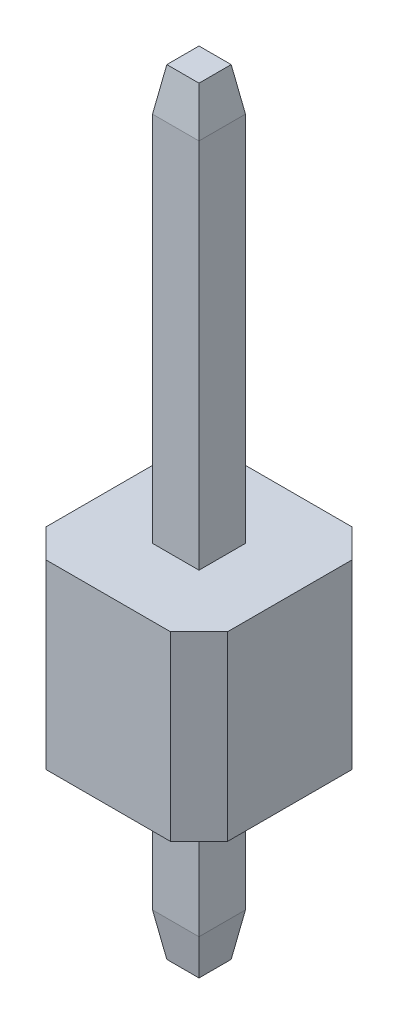
ISO-10303-21;
HEADER;
FILE_DESCRIPTION(('STEP AP214'),'2;1');
FILE_NAME('part.step','',(''),(''),'','','');
FILE_SCHEMA(('AUTOMOTIVE_DESIGN { 1 0 10303 214 1 1 1 1 }'));
ENDSEC;
DATA;
#1=APPLICATION_CONTEXT('core data for automotive mechanical design processes');
#2=APPLICATION_PROTOCOL_DEFINITION('international standard','automotive_design',2000,#1);
#3=PRODUCT_CONTEXT('',#1,'mechanical');
#4=PRODUCT('Part','Part','',(#3));
#5=PRODUCT_RELATED_PRODUCT_CATEGORY('part','',(#4));
#6=PRODUCT_DEFINITION_FORMATION('','',#4);
#7=PRODUCT_DEFINITION_CONTEXT('part definition',#1,'design');
#8=PRODUCT_DEFINITION('design','',#6,#7);
#9=PRODUCT_DEFINITION_SHAPE('','',#8);
#10=(LENGTH_UNIT() NAMED_UNIT(*) SI_UNIT(.MILLI.,.METRE.));
#11=(NAMED_UNIT(*) PLANE_ANGLE_UNIT() SI_UNIT($,.RADIAN.));
#12=(NAMED_UNIT(*) SI_UNIT($,.STERADIAN.) SOLID_ANGLE_UNIT());
#13=UNCERTAINTY_MEASURE_WITH_UNIT(LENGTH_MEASURE(1.E-05),#10,'distance_accuracy_value','');
#14=(GEOMETRIC_REPRESENTATION_CONTEXT(3) GLOBAL_UNCERTAINTY_ASSIGNED_CONTEXT((#13)) GLOBAL_UNIT_ASSIGNED_CONTEXT((#10,
#11,#12)) REPRESENTATION_CONTEXT('',''));
#15=CARTESIAN_POINT('',(0.,0.,0.));
#16=DIRECTION('',(0.,0.,1.));
#17=DIRECTION('',(1.,0.,0.));
#18=AXIS2_PLACEMENT_3D('',#15,#16,#17);
#19=CARTESIAN_POINT('',(-1.27,2.54,1.27));
#20=DIRECTION('',(1.,0.,0.));
#21=DIRECTION('',(0.,0.,-1.));
#22=AXIS2_PLACEMENT_3D('',#19,#20,#21);
#23=PLANE('',#22);
#24=DIRECTION('',(0.,0.,1.));
#25=VECTOR('',#24,1.);
#26=CARTESIAN_POINT('',(-1.27,2.54,1.27));
#27=LINE('',#26,#25);
#28=CARTESIAN_POINT('',(-1.27,2.54,-0.869999999999999));
#29=VERTEX_POINT('',#28);
#30=CARTESIAN_POINT('',(-1.27,2.54,0.869999999999999));
#31=VERTEX_POINT('',#30);
#32=EDGE_CURVE('E235',#29,#31,#27,.T.);
#33=ORIENTED_EDGE('',*,*,#32,.F.);
#34=DIRECTION('',(0.,-1.,0.));
#35=VECTOR('',#34,1.);
#36=CARTESIAN_POINT('',(-1.27,2.54,-0.869999999999999));
#37=LINE('',#36,#35);
#38=CARTESIAN_POINT('',(-1.27,0.,-0.869999999999999));
#39=VERTEX_POINT('',#38);
#40=EDGE_CURVE('E260',#29,#39,#37,.T.);
#41=ORIENTED_EDGE('',*,*,#40,.T.);
#42=DIRECTION('',(0.,0.,1.));
#43=VECTOR('',#42,1.);
#44=CARTESIAN_POINT('',(-1.27,0.,1.27));
#45=LINE('',#44,#43);
#46=CARTESIAN_POINT('',(-1.27,0.,0.869999999999999));
#47=VERTEX_POINT('',#46);
#48=EDGE_CURVE('E234',#39,#47,#45,.T.);
#49=ORIENTED_EDGE('',*,*,#48,.T.);
#50=DIRECTION('',(0.,1.,0.));
#51=VECTOR('',#50,1.);
#52=CARTESIAN_POINT('',(-1.27,2.54,0.869999999999999));
#53=LINE('',#52,#51);
#54=EDGE_CURVE('E248',#47,#31,#53,.T.);
#55=ORIENTED_EDGE('',*,*,#54,.T.);
#56=EDGE_LOOP('',(#33,#41,#49,#55));
#57=FACE_BOUND('',#56,.T.);
#58=ADVANCED_FACE('F39',(#57),#23,.F.);
#59=CARTESIAN_POINT('',(1.27,2.54,1.27));
#60=DIRECTION('',(0.,0.,-1.));
#61=DIRECTION('',(-1.,0.,0.));
#62=AXIS2_PLACEMENT_3D('',#59,#60,#61);
#63=PLANE('',#62);
#64=DIRECTION('',(1.,0.,0.));
#65=VECTOR('',#64,1.);
#66=CARTESIAN_POINT('',(1.27,2.54,1.27));
#67=LINE('',#66,#65);
#68=CARTESIAN_POINT('',(-0.87,2.54,1.27));
#69=VERTEX_POINT('',#68);
#70=CARTESIAN_POINT('',(0.869999999999999,2.54,1.27));
#71=VERTEX_POINT('',#70);
#72=EDGE_CURVE('E238',#69,#71,#67,.T.);
#73=ORIENTED_EDGE('',*,*,#72,.F.);
#74=DIRECTION('',(0.,-1.,0.));
#75=VECTOR('',#74,1.);
#76=CARTESIAN_POINT('',(-0.87,2.54,1.27));
#77=LINE('',#76,#75);
#78=CARTESIAN_POINT('',(-0.87,0.,1.27));
#79=VERTEX_POINT('',#78);
#80=EDGE_CURVE('E291',#69,#79,#77,.T.);
#81=ORIENTED_EDGE('',*,*,#80,.T.);
#82=DIRECTION('',(1.,0.,0.));
#83=VECTOR('',#82,1.);
#84=CARTESIAN_POINT('',(1.27,0.,1.27));
#85=LINE('',#84,#83);
#86=CARTESIAN_POINT('',(0.869999999999999,0.,1.27));
#87=VERTEX_POINT('',#86);
#88=EDGE_CURVE('E251',#79,#87,#85,.T.);
#89=ORIENTED_EDGE('',*,*,#88,.T.);
#90=DIRECTION('',(0.,1.,0.));
#91=VECTOR('',#90,1.);
#92=CARTESIAN_POINT('',(0.869999999999999,2.54,1.27));
#93=LINE('',#92,#91);
#94=EDGE_CURVE('E289',#87,#71,#93,.T.);
#95=ORIENTED_EDGE('',*,*,#94,.T.);
#96=EDGE_LOOP('',(#73,#81,#89,#95));
#97=FACE_BOUND('',#96,.T.);
#98=ADVANCED_FACE('F363',(#97),#63,.F.);
#99=CARTESIAN_POINT('',(1.27,2.54,1.27));
#100=DIRECTION('',(-1.,0.,0.));
#101=DIRECTION('',(0.,0.,1.));
#102=AXIS2_PLACEMENT_3D('',#99,#100,#101);
#103=PLANE('',#102);
#104=DIRECTION('',(0.,0.,-1.));
#105=VECTOR('',#104,1.);
#106=CARTESIAN_POINT('',(1.27,0.,1.27));
#107=LINE('',#106,#105);
#108=CARTESIAN_POINT('',(1.27,0.,0.869999999999999));
#109=VERTEX_POINT('',#108);
#110=CARTESIAN_POINT('',(1.27,0.,-0.869999999999999));
#111=VERTEX_POINT('',#110);
#112=EDGE_CURVE('E254',#109,#111,#107,.T.);
#113=ORIENTED_EDGE('',*,*,#112,.T.);
#114=DIRECTION('',(0.,1.,0.));
#115=VECTOR('',#114,1.);
#116=CARTESIAN_POINT('',(1.27,2.54,-0.869999999999999));
#117=LINE('',#116,#115);
#118=CARTESIAN_POINT('',(1.27,2.54,-0.869999999999999));
#119=VERTEX_POINT('',#118);
#120=EDGE_CURVE('E287',#111,#119,#117,.T.);
#121=ORIENTED_EDGE('',*,*,#120,.T.);
#122=DIRECTION('',(0.,0.,-1.));
#123=VECTOR('',#122,1.);
#124=CARTESIAN_POINT('',(1.27,2.54,1.27));
#125=LINE('',#124,#123);
#126=CARTESIAN_POINT('',(1.27,2.54,0.869999999999999));
#127=VERTEX_POINT('',#126);
#128=EDGE_CURVE('E242',#127,#119,#125,.T.);
#129=ORIENTED_EDGE('',*,*,#128,.F.);
#130=DIRECTION('',(0.,-1.,0.));
#131=VECTOR('',#130,1.);
#132=CARTESIAN_POINT('',(1.27,2.54,0.869999999999999));
#133=LINE('',#132,#131);
#134=EDGE_CURVE('E284',#127,#109,#133,.T.);
#135=ORIENTED_EDGE('',*,*,#134,.T.);
#136=EDGE_LOOP('',(#113,#121,#129,#135));
#137=FACE_BOUND('',#136,.T.);
#138=ADVANCED_FACE('F369',(#137),#103,.F.);
#139=CARTESIAN_POINT('',(1.27,2.54,-1.27));
#140=DIRECTION('',(0.,0.,1.));
#141=DIRECTION('',(1.,0.,0.));
#142=AXIS2_PLACEMENT_3D('',#139,#140,#141);
#143=PLANE('',#142);
#144=DIRECTION('',(-1.,0.,0.));
#145=VECTOR('',#144,1.);
#146=CARTESIAN_POINT('',(1.27,0.,-1.27));
#147=LINE('',#146,#145);
#148=CARTESIAN_POINT('',(0.87,0.,-1.27));
#149=VERTEX_POINT('',#148);
#150=CARTESIAN_POINT('',(-0.869999999999997,0.,-1.27));
#151=VERTEX_POINT('',#150);
#152=EDGE_CURVE('E239',#149,#151,#147,.T.);
#153=ORIENTED_EDGE('',*,*,#152,.T.);
#154=DIRECTION('',(0.,1.,0.));
#155=VECTOR('',#154,1.);
#156=CARTESIAN_POINT('',(-0.869999999999997,2.54,-1.27));
#157=LINE('',#156,#155);
#158=CARTESIAN_POINT('',(-0.869999999999997,2.54,-1.27));
#159=VERTEX_POINT('',#158);
#160=EDGE_CURVE('E274',#151,#159,#157,.T.);
#161=ORIENTED_EDGE('',*,*,#160,.T.);
#162=DIRECTION('',(-1.,0.,0.));
#163=VECTOR('',#162,1.);
#164=CARTESIAN_POINT('',(1.27,2.54,-1.27));
#165=LINE('',#164,#163);
#166=CARTESIAN_POINT('',(0.87,2.54,-1.27));
#167=VERTEX_POINT('',#166);
#168=EDGE_CURVE('E245',#167,#159,#165,.T.);
#169=ORIENTED_EDGE('',*,*,#168,.F.);
#170=DIRECTION('',(0.,-1.,0.));
#171=VECTOR('',#170,1.);
#172=CARTESIAN_POINT('',(0.87,2.54,-1.27));
#173=LINE('',#172,#171);
#174=EDGE_CURVE('E271',#167,#149,#173,.T.);
#175=ORIENTED_EDGE('',*,*,#174,.T.);
#176=EDGE_LOOP('',(#153,#161,#169,#175));
#177=FACE_BOUND('',#176,.T.);
#178=ADVANCED_FACE('F476',(#177),#143,.F.);
#179=CARTESIAN_POINT('',(0.,2.54,0.));
#180=DIRECTION('',(0.,1.,0.));
#181=DIRECTION('',(0.,0.,1.));
#182=AXIS2_PLACEMENT_3D('',#179,#180,#181);
#183=PLANE('',#182);
#184=DIRECTION('',(0.,0.,1.));
#185=VECTOR('',#184,1.);
#186=CARTESIAN_POINT('',(-0.325,2.54,0.325));
#187=LINE('',#186,#185);
#188=CARTESIAN_POINT('',(-0.325,2.54,-0.325));
#189=VERTEX_POINT('',#188);
#190=CARTESIAN_POINT('',(-0.325,2.54,0.325));
#191=VERTEX_POINT('',#190);
#192=EDGE_CURVE('E211',#189,#191,#187,.T.);
#193=ORIENTED_EDGE('',*,*,#192,.F.);
#194=DIRECTION('',(-1.,0.,0.));
#195=VECTOR('',#194,1.);
#196=CARTESIAN_POINT('',(0.325,2.54,-0.325));
#197=LINE('',#196,#195);
#198=CARTESIAN_POINT('',(0.325,2.54,-0.325));
#199=VERTEX_POINT('',#198);
#200=EDGE_CURVE('E223',#199,#189,#197,.T.);
#201=ORIENTED_EDGE('',*,*,#200,.F.);
#202=DIRECTION('',(0.,0.,-1.));
#203=VECTOR('',#202,1.);
#204=CARTESIAN_POINT('',(0.325,2.54,0.325));
#205=LINE('',#204,#203);
#206=CARTESIAN_POINT('',(0.325,2.54,0.325));
#207=VERTEX_POINT('',#206);
#208=EDGE_CURVE('E220',#207,#199,#205,.T.);
#209=ORIENTED_EDGE('',*,*,#208,.F.);
#210=DIRECTION('',(1.,0.,0.));
#211=VECTOR('',#210,1.);
#212=CARTESIAN_POINT('',(0.325,2.54,0.325));
#213=LINE('',#212,#211);
#214=EDGE_CURVE('E217',#191,#207,#213,.T.);
#215=ORIENTED_EDGE('',*,*,#214,.F.);
#216=EDGE_LOOP('',(#193,#201,#209,#215));
#217=FACE_BOUND('',#216,.T.);
#218=ORIENTED_EDGE('',*,*,#168,.T.);
#219=DIRECTION('',(0.707106781186549,0.,-0.707106781186546));
#220=VECTOR('',#219,1.);
#221=CARTESIAN_POINT('',(-1.07,2.54,-1.07));
#222=LINE('',#221,#220);
#223=EDGE_CURVE('E282',#159,#29,#222,.F.);
#224=ORIENTED_EDGE('',*,*,#223,.T.);
#225=ORIENTED_EDGE('',*,*,#32,.T.);
#226=DIRECTION('',(-0.707106781186546,0.,-0.707106781186549));
#227=VECTOR('',#226,1.);
#228=CARTESIAN_POINT('',(-1.07,2.54,1.07));
#229=LINE('',#228,#227);
#230=EDGE_CURVE('E278',#31,#69,#229,.F.);
#231=ORIENTED_EDGE('',*,*,#230,.T.);
#232=ORIENTED_EDGE('',*,*,#72,.T.);
#233=DIRECTION('',(-0.707106781186548,0.,0.707106781186547));
#234=VECTOR('',#233,1.);
#235=CARTESIAN_POINT('',(1.07,2.54,1.07));
#236=LINE('',#235,#234);
#237=EDGE_CURVE('E276',#71,#127,#236,.F.);
#238=ORIENTED_EDGE('',*,*,#237,.T.);
#239=ORIENTED_EDGE('',*,*,#128,.T.);
#240=DIRECTION('',(0.707106781186546,0.,0.707106781186549));
#241=VECTOR('',#240,1.);
#242=CARTESIAN_POINT('',(1.07,2.54,-1.07));
#243=LINE('',#242,#241);
#244=EDGE_CURVE('E280',#119,#167,#243,.F.);
#245=ORIENTED_EDGE('',*,*,#244,.T.);
#246=EDGE_LOOP('',(#218,#224,#225,#231,#232,#238,#239,#245));
#247=FACE_BOUND('',#246,.T.);
#248=ADVANCED_FACE('F473',(#217,#247),#183,.T.);
#249=CARTESIAN_POINT('',(0.,0.,0.));
#250=DIRECTION('',(0.,1.,0.));
#251=DIRECTION('',(0.,0.,1.));
#252=AXIS2_PLACEMENT_3D('',#249,#250,#251);
#253=PLANE('',#252);
#254=DIRECTION('',(-1.,0.,0.));
#255=VECTOR('',#254,1.);
#256=CARTESIAN_POINT('',(0.,0.,-0.325));
#257=LINE('',#256,#255);
#258=CARTESIAN_POINT('',(0.325,0.,-0.325));
#259=VERTEX_POINT('',#258);
#260=CARTESIAN_POINT('',(-0.325,0.,-0.325));
#261=VERTEX_POINT('',#260);
#262=EDGE_CURVE('E188',#259,#261,#257,.T.);
#263=ORIENTED_EDGE('',*,*,#262,.T.);
#264=DIRECTION('',(0.,0.,1.));
#265=VECTOR('',#264,1.);
#266=CARTESIAN_POINT('',(-0.325,0.,0.));
#267=LINE('',#266,#265);
#268=CARTESIAN_POINT('',(-0.325,0.,0.325));
#269=VERTEX_POINT('',#268);
#270=EDGE_CURVE('E183',#261,#269,#267,.T.);
#271=ORIENTED_EDGE('',*,*,#270,.T.);
#272=DIRECTION('',(1.,0.,0.));
#273=VECTOR('',#272,1.);
#274=CARTESIAN_POINT('',(0.,0.,0.325));
#275=LINE('',#274,#273);
#276=CARTESIAN_POINT('',(0.325,0.,0.325));
#277=VERTEX_POINT('',#276);
#278=EDGE_CURVE('E191',#269,#277,#275,.T.);
#279=ORIENTED_EDGE('',*,*,#278,.T.);
#280=DIRECTION('',(0.,0.,-1.));
#281=VECTOR('',#280,1.);
#282=CARTESIAN_POINT('',(0.325,0.,0.));
#283=LINE('',#282,#281);
#284=EDGE_CURVE('E196',#277,#259,#283,.T.);
#285=ORIENTED_EDGE('',*,*,#284,.T.);
#286=EDGE_LOOP('',(#263,#271,#279,#285));
#287=FACE_BOUND('',#286,.T.);
#288=ORIENTED_EDGE('',*,*,#48,.F.);
#289=DIRECTION('',(-0.707106781186549,0.,0.707106781186546));
#290=VECTOR('',#289,1.);
#291=CARTESIAN_POINT('',(-1.27,0.,-0.869999999999999));
#292=LINE('',#291,#290);
#293=EDGE_CURVE('E269',#39,#151,#292,.F.);
#294=ORIENTED_EDGE('',*,*,#293,.T.);
#295=ORIENTED_EDGE('',*,*,#152,.F.);
#296=DIRECTION('',(-0.707106781186546,0.,-0.707106781186549));
#297=VECTOR('',#296,1.);
#298=CARTESIAN_POINT('',(0.87,0.,-1.27));
#299=LINE('',#298,#297);
#300=EDGE_CURVE('E267',#149,#111,#299,.F.);
#301=ORIENTED_EDGE('',*,*,#300,.T.);
#302=ORIENTED_EDGE('',*,*,#112,.F.);
#303=DIRECTION('',(0.707106781186548,0.,-0.707106781186547));
#304=VECTOR('',#303,1.);
#305=CARTESIAN_POINT('',(1.27,0.,0.869999999999999));
#306=LINE('',#305,#304);
#307=EDGE_CURVE('E263',#109,#87,#306,.F.);
#308=ORIENTED_EDGE('',*,*,#307,.T.);
#309=ORIENTED_EDGE('',*,*,#88,.F.);
#310=DIRECTION('',(0.707106781186546,0.,0.707106781186549));
#311=VECTOR('',#310,1.);
#312=CARTESIAN_POINT('',(-0.87,0.,1.27));
#313=LINE('',#312,#311);
#314=EDGE_CURVE('E265',#79,#47,#313,.F.);
#315=ORIENTED_EDGE('',*,*,#314,.T.);
#316=EDGE_LOOP('',(#288,#294,#295,#301,#302,#308,#309,#315));
#317=FACE_BOUND('',#316,.T.);
#318=ADVANCED_FACE('F198',(#287,#317),#253,.F.);
#319=CARTESIAN_POINT('',(-1.27,2.54,-0.869999999999999));
#320=DIRECTION('',(0.707106781186546,0.,0.707106781186549));
#321=DIRECTION('',(0.,-1.,0.));
#322=AXIS2_PLACEMENT_3D('',#319,#320,#321);
#323=PLANE('',#322);
#324=ORIENTED_EDGE('',*,*,#223,.F.);
#325=ORIENTED_EDGE('',*,*,#160,.F.);
#326=ORIENTED_EDGE('',*,*,#293,.F.);
#327=ORIENTED_EDGE('',*,*,#40,.F.);
#328=EDGE_LOOP('',(#324,#325,#326,#327));
#329=FACE_BOUND('',#328,.T.);
#330=ADVANCED_FACE('F376',(#329),#323,.F.);
#331=CARTESIAN_POINT('',(0.87,2.54,-1.27));
#332=DIRECTION('',(-0.707106781186549,0.,0.707106781186546));
#333=DIRECTION('',(0.,-1.,0.));
#334=AXIS2_PLACEMENT_3D('',#331,#332,#333);
#335=PLANE('',#334);
#336=ORIENTED_EDGE('',*,*,#244,.F.);
#337=ORIENTED_EDGE('',*,*,#120,.F.);
#338=ORIENTED_EDGE('',*,*,#300,.F.);
#339=ORIENTED_EDGE('',*,*,#174,.F.);
#340=EDGE_LOOP('',(#336,#337,#338,#339));
#341=FACE_BOUND('',#340,.T.);
#342=ADVANCED_FACE('F382',(#341),#335,.F.);
#343=CARTESIAN_POINT('',(-0.87,2.54,1.27));
#344=DIRECTION('',(0.707106781186549,0.,-0.707106781186546));
#345=DIRECTION('',(0.,-1.,0.));
#346=AXIS2_PLACEMENT_3D('',#343,#344,#345);
#347=PLANE('',#346);
#348=ORIENTED_EDGE('',*,*,#230,.F.);
#349=ORIENTED_EDGE('',*,*,#54,.F.);
#350=ORIENTED_EDGE('',*,*,#314,.F.);
#351=ORIENTED_EDGE('',*,*,#80,.F.);
#352=EDGE_LOOP('',(#348,#349,#350,#351));
#353=FACE_BOUND('',#352,.T.);
#354=ADVANCED_FACE('F389',(#353),#347,.F.);
#355=CARTESIAN_POINT('',(1.27,2.54,0.869999999999999));
#356=DIRECTION('',(-0.707106781186547,0.,-0.707106781186548));
#357=DIRECTION('',(0.,-1.,0.));
#358=AXIS2_PLACEMENT_3D('',#355,#356,#357);
#359=PLANE('',#358);
#360=ORIENTED_EDGE('',*,*,#237,.F.);
#361=ORIENTED_EDGE('',*,*,#94,.F.);
#362=ORIENTED_EDGE('',*,*,#307,.F.);
#363=ORIENTED_EDGE('',*,*,#134,.F.);
#364=EDGE_LOOP('',(#360,#361,#362,#363));
#365=FACE_BOUND('',#364,.T.);
#366=ADVANCED_FACE('F396',(#365),#359,.F.);
#367=CARTESIAN_POINT('',(-0.325,8.34,0.325));
#368=DIRECTION('',(1.,0.,0.));
#369=DIRECTION('',(0.,0.,-1.));
#370=AXIS2_PLACEMENT_3D('',#367,#368,#369);
#371=PLANE('',#370);
#372=DIRECTION('',(0.,-1.,0.));
#373=VECTOR('',#372,1.);
#374=CARTESIAN_POINT('',(-0.325,8.34,0.325));
#375=LINE('',#374,#373);
#376=CARTESIAN_POINT('',(-0.325,7.73999999999999,0.325));
#377=VERTEX_POINT('',#376);
#378=EDGE_CURVE('E232',#377,#191,#375,.T.);
#379=ORIENTED_EDGE('',*,*,#378,.F.);
#380=DIRECTION('',(0.,0.,-1.));
#381=VECTOR('',#380,1.);
#382=CARTESIAN_POINT('',(-0.325,7.73999999999999,-0.325));
#383=LINE('',#382,#381);
#384=CARTESIAN_POINT('',(-0.325,7.73999999999999,-0.325));
#385=VERTEX_POINT('',#384);
#386=EDGE_CURVE('E303',#377,#385,#383,.T.);
#387=ORIENTED_EDGE('',*,*,#386,.T.);
#388=DIRECTION('',(0.,-1.,0.));
#389=VECTOR('',#388,1.);
#390=CARTESIAN_POINT('',(-0.325,8.34,-0.325));
#391=LINE('',#390,#389);
#392=EDGE_CURVE('E226',#385,#189,#391,.T.);
#393=ORIENTED_EDGE('',*,*,#392,.T.);
#394=ORIENTED_EDGE('',*,*,#192,.T.);
#395=EDGE_LOOP('',(#379,#387,#393,#394));
#396=FACE_BOUND('',#395,.T.);
#397=ADVANCED_FACE('F403',(#396),#371,.F.);
#398=CARTESIAN_POINT('',(0.325,8.34,0.325));
#399=DIRECTION('',(0.,0.,-1.));
#400=DIRECTION('',(-1.,0.,0.));
#401=AXIS2_PLACEMENT_3D('',#398,#399,#400);
#402=PLANE('',#401);
#403=DIRECTION('',(0.,-1.,0.));
#404=VECTOR('',#403,1.);
#405=CARTESIAN_POINT('',(0.325,8.34,0.325));
#406=LINE('',#405,#404);
#407=CARTESIAN_POINT('',(0.325,7.73999999999999,0.325));
#408=VERTEX_POINT('',#407);
#409=EDGE_CURVE('E230',#408,#207,#406,.T.);
#410=ORIENTED_EDGE('',*,*,#409,.F.);
#411=DIRECTION('',(-1.,0.,0.));
#412=VECTOR('',#411,1.);
#413=CARTESIAN_POINT('',(-0.325,7.73999999999999,0.325));
#414=LINE('',#413,#412);
#415=EDGE_CURVE('E308',#408,#377,#414,.T.);
#416=ORIENTED_EDGE('',*,*,#415,.T.);
#417=ORIENTED_EDGE('',*,*,#378,.T.);
#418=ORIENTED_EDGE('',*,*,#214,.T.);
#419=EDGE_LOOP('',(#410,#416,#417,#418));
#420=FACE_BOUND('',#419,.T.);
#421=ADVANCED_FACE('F455',(#420),#402,.F.);
#422=CARTESIAN_POINT('',(0.325,8.34,0.325));
#423=DIRECTION('',(-1.,0.,0.));
#424=DIRECTION('',(0.,0.,1.));
#425=AXIS2_PLACEMENT_3D('',#422,#423,#424);
#426=PLANE('',#425);
#427=DIRECTION('',(0.,-1.,0.));
#428=VECTOR('',#427,1.);
#429=CARTESIAN_POINT('',(0.325,8.34,-0.325));
#430=LINE('',#429,#428);
#431=CARTESIAN_POINT('',(0.325,7.73999999999999,-0.325));
#432=VERTEX_POINT('',#431);
#433=EDGE_CURVE('E228',#432,#199,#430,.T.);
#434=ORIENTED_EDGE('',*,*,#433,.F.);
#435=DIRECTION('',(0.,0.,1.));
#436=VECTOR('',#435,1.);
#437=CARTESIAN_POINT('',(0.325,7.73999999999999,0.325));
#438=LINE('',#437,#436);
#439=EDGE_CURVE('E310',#432,#408,#438,.T.);
#440=ORIENTED_EDGE('',*,*,#439,.T.);
#441=ORIENTED_EDGE('',*,*,#409,.T.);
#442=ORIENTED_EDGE('',*,*,#208,.T.);
#443=EDGE_LOOP('',(#434,#440,#441,#442));
#444=FACE_BOUND('',#443,.T.);
#445=ADVANCED_FACE('F470',(#444),#426,.F.);
#446=CARTESIAN_POINT('',(0.325,8.34,-0.325));
#447=DIRECTION('',(0.,0.,1.));
#448=DIRECTION('',(1.,0.,0.));
#449=AXIS2_PLACEMENT_3D('',#446,#447,#448);
#450=PLANE('',#449);
#451=ORIENTED_EDGE('',*,*,#392,.F.);
#452=DIRECTION('',(1.,0.,0.));
#453=VECTOR('',#452,1.);
#454=CARTESIAN_POINT('',(0.325,7.73999999999999,-0.325));
#455=LINE('',#454,#453);
#456=EDGE_CURVE('E306',#385,#432,#455,.T.);
#457=ORIENTED_EDGE('',*,*,#456,.T.);
#458=ORIENTED_EDGE('',*,*,#433,.T.);
#459=ORIENTED_EDGE('',*,*,#200,.T.);
#460=EDGE_LOOP('',(#451,#457,#458,#459));
#461=FACE_BOUND('',#460,.T.);
#462=ADVANCED_FACE('F467',(#461),#450,.F.);
#463=CARTESIAN_POINT('',(0.,8.34,0.));
#464=DIRECTION('',(0.,1.,0.));
#465=DIRECTION('',(0.,0.,1.));
#466=AXIS2_PLACEMENT_3D('',#463,#464,#465);
#467=PLANE('',#466);
#468=DIRECTION('',(-1.,0.,0.));
#469=VECTOR('',#468,1.);
#470=CARTESIAN_POINT('',(-0.325,8.34,-0.225));
#471=LINE('',#470,#469);
#472=CARTESIAN_POINT('',(0.225,8.34,-0.225));
#473=VERTEX_POINT('',#472);
#474=CARTESIAN_POINT('',(-0.225,8.34,-0.225));
#475=VERTEX_POINT('',#474);
#476=EDGE_CURVE('E298',#473,#475,#471,.T.);
#477=ORIENTED_EDGE('',*,*,#476,.T.);
#478=DIRECTION('',(0.,0.,1.));
#479=VECTOR('',#478,1.);
#480=CARTESIAN_POINT('',(-0.225,8.34,0.325));
#481=LINE('',#480,#479);
#482=CARTESIAN_POINT('',(-0.225,8.34,0.225));
#483=VERTEX_POINT('',#482);
#484=EDGE_CURVE('E300',#475,#483,#481,.T.);
#485=ORIENTED_EDGE('',*,*,#484,.T.);
#486=DIRECTION('',(1.,0.,0.));
#487=VECTOR('',#486,1.);
#488=CARTESIAN_POINT('',(0.325,8.34,0.225));
#489=LINE('',#488,#487);
#490=CARTESIAN_POINT('',(0.225,8.34,0.225));
#491=VERTEX_POINT('',#490);
#492=EDGE_CURVE('E296',#483,#491,#489,.T.);
#493=ORIENTED_EDGE('',*,*,#492,.T.);
#494=DIRECTION('',(0.,0.,-1.));
#495=VECTOR('',#494,1.);
#496=CARTESIAN_POINT('',(0.225,8.34,-0.325));
#497=LINE('',#496,#495);
#498=EDGE_CURVE('E294',#491,#473,#497,.T.);
#499=ORIENTED_EDGE('',*,*,#498,.T.);
#500=EDGE_LOOP('',(#477,#485,#493,#499));
#501=FACE_BOUND('',#500,.T.);
#502=ADVANCED_FACE('F515',(#501),#467,.T.);
#503=CARTESIAN_POINT('',(-0.325,-2.5,0.));
#504=DIRECTION('',(-1.,0.,0.));
#505=DIRECTION('',(0.,0.,1.));
#506=AXIS2_PLACEMENT_3D('',#503,#504,#505);
#507=PLANE('',#506);
#508=DIRECTION('',(0.,1.,0.));
#509=VECTOR('',#508,1.);
#510=CARTESIAN_POINT('',(-0.325,-2.5,-0.325));
#511=LINE('',#510,#509);
#512=CARTESIAN_POINT('',(-0.325,-1.89999999999999,-0.325));
#513=VERTEX_POINT('',#512);
#514=EDGE_CURVE('E209',#513,#261,#511,.T.);
#515=ORIENTED_EDGE('',*,*,#514,.F.);
#516=DIRECTION('',(0.,0.,1.));
#517=VECTOR('',#516,1.);
#518=CARTESIAN_POINT('',(-0.325,-1.89999999999999,0.325));
#519=LINE('',#518,#517);
#520=CARTESIAN_POINT('',(-0.325,-1.89999999999999,0.325));
#521=VERTEX_POINT('',#520);
#522=EDGE_CURVE('E186',#513,#521,#519,.T.);
#523=ORIENTED_EDGE('',*,*,#522,.T.);
#524=DIRECTION('',(0.,1.,0.));
#525=VECTOR('',#524,1.);
#526=CARTESIAN_POINT('',(-0.325,-2.5,0.325));
#527=LINE('',#526,#525);
#528=EDGE_CURVE('E178',#521,#269,#527,.T.);
#529=ORIENTED_EDGE('',*,*,#528,.T.);
#530=ORIENTED_EDGE('',*,*,#270,.F.);
#531=EDGE_LOOP('',(#515,#523,#529,#530));
#532=FACE_BOUND('',#531,.T.);
#533=ADVANCED_FACE('F181',(#532),#507,.T.);
#534=CARTESIAN_POINT('',(0.,-2.5,-0.325));
#535=DIRECTION('',(0.,0.,-1.));
#536=DIRECTION('',(-1.,0.,0.));
#537=AXIS2_PLACEMENT_3D('',#534,#535,#536);
#538=PLANE('',#537);
#539=DIRECTION('',(0.,1.,0.));
#540=VECTOR('',#539,1.);
#541=CARTESIAN_POINT('',(0.325,-2.5,-0.325));
#542=LINE('',#541,#540);
#543=CARTESIAN_POINT('',(0.325,-1.89999999999999,-0.325));
#544=VERTEX_POINT('',#543);
#545=EDGE_CURVE('E212',#544,#259,#542,.T.);
#546=ORIENTED_EDGE('',*,*,#545,.F.);
#547=DIRECTION('',(-1.,0.,0.));
#548=VECTOR('',#547,1.);
#549=CARTESIAN_POINT('',(-0.325,-1.89999999999999,-0.325));
#550=LINE('',#549,#548);
#551=EDGE_CURVE('E11',#544,#513,#550,.T.);
#552=ORIENTED_EDGE('',*,*,#551,.T.);
#553=ORIENTED_EDGE('',*,*,#514,.T.);
#554=ORIENTED_EDGE('',*,*,#262,.F.);
#555=EDGE_LOOP('',(#546,#552,#553,#554));
#556=FACE_BOUND('',#555,.T.);
#557=ADVANCED_FACE('F521',(#556),#538,.T.);
#558=CARTESIAN_POINT('',(0.325,-2.5,0.));
#559=DIRECTION('',(1.,0.,0.));
#560=DIRECTION('',(0.,0.,-1.));
#561=AXIS2_PLACEMENT_3D('',#558,#559,#560);
#562=PLANE('',#561);
#563=DIRECTION('',(0.,1.,0.));
#564=VECTOR('',#563,1.);
#565=CARTESIAN_POINT('',(0.325,-2.5,0.325));
#566=LINE('',#565,#564);
#567=CARTESIAN_POINT('',(0.325,-1.89999999999999,0.325));
#568=VERTEX_POINT('',#567);
#569=EDGE_CURVE('E187',#568,#277,#566,.T.);
#570=ORIENTED_EDGE('',*,*,#569,.F.);
#571=DIRECTION('',(0.,0.,-1.));
#572=VECTOR('',#571,1.);
#573=CARTESIAN_POINT('',(0.325,-1.89999999999999,-0.325));
#574=LINE('',#573,#572);
#575=EDGE_CURVE('E49',#568,#544,#574,.T.);
#576=ORIENTED_EDGE('',*,*,#575,.T.);
#577=ORIENTED_EDGE('',*,*,#545,.T.);
#578=ORIENTED_EDGE('',*,*,#284,.F.);
#579=EDGE_LOOP('',(#570,#576,#577,#578));
#580=FACE_BOUND('',#579,.T.);
#581=ADVANCED_FACE('F524',(#580),#562,.T.);
#582=CARTESIAN_POINT('',(0.,-2.5,0.325));
#583=DIRECTION('',(0.,0.,1.));
#584=DIRECTION('',(1.,0.,0.));
#585=AXIS2_PLACEMENT_3D('',#582,#583,#584);
#586=PLANE('',#585);
#587=ORIENTED_EDGE('',*,*,#528,.F.);
#588=DIRECTION('',(1.,0.,0.));
#589=VECTOR('',#588,1.);
#590=CARTESIAN_POINT('',(0.325,-1.89999999999999,0.325));
#591=LINE('',#590,#589);
#592=EDGE_CURVE('E64',#521,#568,#591,.T.);
#593=ORIENTED_EDGE('',*,*,#592,.T.);
#594=ORIENTED_EDGE('',*,*,#569,.T.);
#595=ORIENTED_EDGE('',*,*,#278,.F.);
#596=EDGE_LOOP('',(#587,#593,#594,#595));
#597=FACE_BOUND('',#596,.T.);
#598=ADVANCED_FACE('F192',(#597),#586,.T.);
#599=CARTESIAN_POINT('',(0.,-2.5,0.));
#600=DIRECTION('',(0.,1.,0.));
#601=DIRECTION('',(0.,0.,1.));
#602=AXIS2_PLACEMENT_3D('',#599,#600,#601);
#603=PLANE('',#602);
#604=DIRECTION('',(-1.,0.,0.));
#605=VECTOR('',#604,1.);
#606=CARTESIAN_POINT('',(-0.325,-2.5,0.225));
#607=LINE('',#606,#605);
#608=CARTESIAN_POINT('',(0.225,-2.5,0.225));
#609=VERTEX_POINT('',#608);
#610=CARTESIAN_POINT('',(-0.225,-2.5,0.225));
#611=VERTEX_POINT('',#610);
#612=EDGE_CURVE('E323',#609,#611,#607,.T.);
#613=ORIENTED_EDGE('',*,*,#612,.T.);
#614=DIRECTION('',(0.,0.,-1.));
#615=VECTOR('',#614,1.);
#616=CARTESIAN_POINT('',(-0.225,-2.5,-0.325));
#617=LINE('',#616,#615);
#618=CARTESIAN_POINT('',(-0.225,-2.5,-0.225));
#619=VERTEX_POINT('',#618);
#620=EDGE_CURVE('E325',#611,#619,#617,.T.);
#621=ORIENTED_EDGE('',*,*,#620,.T.);
#622=DIRECTION('',(1.,0.,0.));
#623=VECTOR('',#622,1.);
#624=CARTESIAN_POINT('',(0.325,-2.5,-0.225));
#625=LINE('',#624,#623);
#626=CARTESIAN_POINT('',(0.225,-2.5,-0.225));
#627=VERTEX_POINT('',#626);
#628=EDGE_CURVE('E319',#619,#627,#625,.T.);
#629=ORIENTED_EDGE('',*,*,#628,.T.);
#630=DIRECTION('',(0.,0.,1.));
#631=VECTOR('',#630,1.);
#632=CARTESIAN_POINT('',(0.225,-2.5,0.325));
#633=LINE('',#632,#631);
#634=EDGE_CURVE('E321',#627,#609,#633,.T.);
#635=ORIENTED_EDGE('',*,*,#634,.T.);
#636=EDGE_LOOP('',(#613,#621,#629,#635));
#637=FACE_BOUND('',#636,.T.);
#638=ADVANCED_FACE('F348',(#637),#603,.F.);
#639=CARTESIAN_POINT('',(0.225,8.34,0.));
#640=DIRECTION('',(0.986393923832144,0.164398987305354,0.));
#641=DIRECTION('',(0.,0.,1.));
#642=AXIS2_PLACEMENT_3D('',#639,#640,#641);
#643=PLANE('',#642);
#644=DIRECTION('',(0.162221421130759,-0.973328526784576,0.162221421130759));
#645=VECTOR('',#644,1.);
#646=CARTESIAN_POINT('',(0.219078947368421,8.37552631578947,0.219078947368421));
#647=LINE('',#646,#645);
#648=EDGE_CURVE('E204',#408,#491,#647,.F.);
#649=ORIENTED_EDGE('',*,*,#648,.F.);
#650=ORIENTED_EDGE('',*,*,#439,.F.);
#651=DIRECTION('',(-0.162221421130759,0.973328526784576,0.162221421130759));
#652=VECTOR('',#651,1.);
#653=CARTESIAN_POINT('',(0.219078947368421,8.37552631578947,-0.219078947368421));
#654=LINE('',#653,#652);
#655=EDGE_CURVE('E201',#473,#432,#654,.F.);
#656=ORIENTED_EDGE('',*,*,#655,.F.);
#657=ORIENTED_EDGE('',*,*,#498,.F.);
#658=EDGE_LOOP('',(#649,#650,#656,#657));
#659=FACE_BOUND('',#658,.T.);
#660=ADVANCED_FACE('F425',(#659),#643,.T.);
#661=CARTESIAN_POINT('',(0.,8.34,-0.225));
#662=DIRECTION('',(0.,0.164398987305354,-0.986393923832144));
#663=DIRECTION('',(1.,0.,0.));
#664=AXIS2_PLACEMENT_3D('',#661,#662,#663);
#665=PLANE('',#664);
#666=ORIENTED_EDGE('',*,*,#655,.T.);
#667=ORIENTED_EDGE('',*,*,#456,.F.);
#668=DIRECTION('',(0.162221421130759,0.973328526784576,0.162221421130759));
#669=VECTOR('',#668,1.);
#670=CARTESIAN_POINT('',(-0.219078947368421,8.37552631578947,-0.219078947368421));
#671=LINE('',#670,#669);
#672=EDGE_CURVE('E314',#475,#385,#671,.F.);
#673=ORIENTED_EDGE('',*,*,#672,.F.);
#674=ORIENTED_EDGE('',*,*,#476,.F.);
#675=EDGE_LOOP('',(#666,#667,#673,#674));
#676=FACE_BOUND('',#675,.T.);
#677=ADVANCED_FACE('F419',(#676),#665,.T.);
#678=CARTESIAN_POINT('',(0.,8.34,0.225));
#679=DIRECTION('',(0.,0.164398987305354,0.986393923832144));
#680=DIRECTION('',(-1.,0.,0.));
#681=AXIS2_PLACEMENT_3D('',#678,#679,#680);
#682=PLANE('',#681);
#683=ORIENTED_EDGE('',*,*,#648,.T.);
#684=ORIENTED_EDGE('',*,*,#492,.F.);
#685=DIRECTION('',(-0.162221421130759,-0.973328526784576,0.162221421130759));
#686=VECTOR('',#685,1.);
#687=CARTESIAN_POINT('',(-0.219078947368421,8.37552631578947,0.219078947368421));
#688=LINE('',#687,#686);
#689=EDGE_CURVE('E312',#377,#483,#688,.F.);
#690=ORIENTED_EDGE('',*,*,#689,.F.);
#691=ORIENTED_EDGE('',*,*,#415,.F.);
#692=EDGE_LOOP('',(#683,#684,#690,#691));
#693=FACE_BOUND('',#692,.T.);
#694=ADVANCED_FACE('F412',(#693),#682,.T.);
#695=CARTESIAN_POINT('',(-0.225,8.34,0.));
#696=DIRECTION('',(-0.986393923832144,0.164398987305354,0.));
#697=DIRECTION('',(0.,0.,-1.));
#698=AXIS2_PLACEMENT_3D('',#695,#696,#697);
#699=PLANE('',#698);
#700=ORIENTED_EDGE('',*,*,#672,.T.);
#701=ORIENTED_EDGE('',*,*,#386,.F.);
#702=ORIENTED_EDGE('',*,*,#689,.T.);
#703=ORIENTED_EDGE('',*,*,#484,.F.);
#704=EDGE_LOOP('',(#700,#701,#702,#703));
#705=FACE_BOUND('',#704,.T.);
#706=ADVANCED_FACE('F406',(#705),#699,.T.);
#707=CARTESIAN_POINT('',(0.325,-1.89999999999999,0.));
#708=DIRECTION('',(0.986393923832144,-0.164398987305354,0.));
#709=DIRECTION('',(0.,0.,1.));
#710=AXIS2_PLACEMENT_3D('',#707,#708,#709);
#711=PLANE('',#710);
#712=DIRECTION('',(-0.16222142113076,-0.973328526784576,-0.16222142113076));
#713=VECTOR('',#712,1.);
#714=CARTESIAN_POINT('',(0.316447368421053,-1.95131578947367,0.316447368421053));
#715=LINE('',#714,#713);
#716=EDGE_CURVE('E333',#609,#568,#715,.F.);
#717=ORIENTED_EDGE('',*,*,#716,.F.);
#718=ORIENTED_EDGE('',*,*,#634,.F.);
#719=DIRECTION('',(-0.16222142113076,-0.973328526784576,0.16222142113076));
#720=VECTOR('',#719,1.);
#721=CARTESIAN_POINT('',(0.316447368421053,-1.95131578947367,-0.316447368421053));
#722=LINE('',#721,#720);
#723=EDGE_CURVE('E44',#544,#627,#722,.T.);
#724=ORIENTED_EDGE('',*,*,#723,.F.);
#725=ORIENTED_EDGE('',*,*,#575,.F.);
#726=EDGE_LOOP('',(#717,#718,#724,#725));
#727=FACE_BOUND('',#726,.T.);
#728=ADVANCED_FACE('F42',(#727),#711,.T.);
#729=CARTESIAN_POINT('',(0.,-1.89999999999999,-0.325));
#730=DIRECTION('',(0.,-0.164398987305354,-0.986393923832144));
#731=DIRECTION('',(1.,0.,0.));
#732=AXIS2_PLACEMENT_3D('',#729,#730,#731);
#733=PLANE('',#732);
#734=ORIENTED_EDGE('',*,*,#723,.T.);
#735=ORIENTED_EDGE('',*,*,#628,.F.);
#736=DIRECTION('',(-0.16222142113076,0.973328526784576,-0.16222142113076));
#737=VECTOR('',#736,1.);
#738=CARTESIAN_POINT('',(-0.316447368421053,-1.95131578947367,-0.316447368421053));
#739=LINE('',#738,#737);
#740=EDGE_CURVE('E332',#513,#619,#739,.F.);
#741=ORIENTED_EDGE('',*,*,#740,.F.);
#742=ORIENTED_EDGE('',*,*,#551,.F.);
#743=EDGE_LOOP('',(#734,#735,#741,#742));
#744=FACE_BOUND('',#743,.T.);
#745=ADVANCED_FACE('F343',(#744),#733,.T.);
#746=CARTESIAN_POINT('',(0.,-1.89999999999999,0.325));
#747=DIRECTION('',(0.,-0.164398987305354,0.986393923832144));
#748=DIRECTION('',(-1.,0.,0.));
#749=AXIS2_PLACEMENT_3D('',#746,#747,#748);
#750=PLANE('',#749);
#751=ORIENTED_EDGE('',*,*,#716,.T.);
#752=ORIENTED_EDGE('',*,*,#592,.F.);
#753=DIRECTION('',(0.16222142113076,-0.973328526784576,-0.16222142113076));
#754=VECTOR('',#753,1.);
#755=CARTESIAN_POINT('',(-0.316447368421053,-1.95131578947367,0.316447368421053));
#756=LINE('',#755,#754);
#757=EDGE_CURVE('E330',#611,#521,#756,.F.);
#758=ORIENTED_EDGE('',*,*,#757,.F.);
#759=ORIENTED_EDGE('',*,*,#612,.F.);
#760=EDGE_LOOP('',(#751,#752,#758,#759));
#761=FACE_BOUND('',#760,.T.);
#762=ADVANCED_FACE('F353',(#761),#750,.T.);
#763=CARTESIAN_POINT('',(-0.325,-1.89999999999999,0.));
#764=DIRECTION('',(-0.986393923832144,-0.164398987305354,0.));
#765=DIRECTION('',(0.,0.,-1.));
#766=AXIS2_PLACEMENT_3D('',#763,#764,#765);
#767=PLANE('',#766);
#768=ORIENTED_EDGE('',*,*,#740,.T.);
#769=ORIENTED_EDGE('',*,*,#620,.F.);
#770=ORIENTED_EDGE('',*,*,#757,.T.);
#771=ORIENTED_EDGE('',*,*,#522,.F.);
#772=EDGE_LOOP('',(#768,#769,#770,#771));
#773=FACE_BOUND('',#772,.T.);
#774=ADVANCED_FACE('F352',(#773),#767,.T.);
#775=CLOSED_SHELL('',(#58,#98,#138,#178,#248,#318,#330,#342,#354,#366,#397,#421,#445,#462,#502,
#533,#557,#581,#598,#638,#660,#677,#694,#706,#728,#745,#762,#774));
#776=MANIFOLD_SOLID_BREP('B2',#775);
#777=ADVANCED_BREP_SHAPE_REPRESENTATION('',(#18,#776),#14);
#778=SHAPE_DEFINITION_REPRESENTATION(#9,#777);
ENDSEC;
END-ISO-10303-21;
